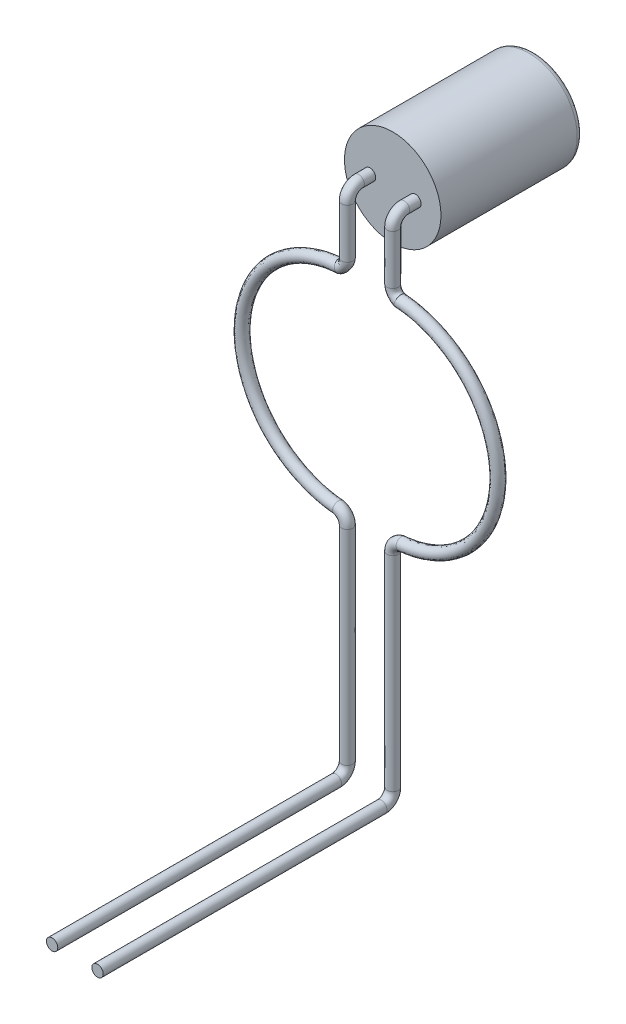
ISO-10303-21;
HEADER;
FILE_DESCRIPTION(('STEP AP214'),'2;1');
FILE_NAME('part.step','',(''),(''),'','','');
FILE_SCHEMA(('AUTOMOTIVE_DESIGN { 1 0 10303 214 1 1 1 1 }'));
ENDSEC;
DATA;
#1=APPLICATION_CONTEXT('core data for automotive mechanical design processes');
#2=APPLICATION_PROTOCOL_DEFINITION('international standard','automotive_design',2000,#1);
#3=PRODUCT_CONTEXT('',#1,'mechanical');
#4=PRODUCT('Part','Part','',(#3));
#5=PRODUCT_RELATED_PRODUCT_CATEGORY('part','',(#4));
#6=PRODUCT_DEFINITION_FORMATION('','',#4);
#7=PRODUCT_DEFINITION_CONTEXT('part definition',#1,'design');
#8=PRODUCT_DEFINITION('design','',#6,#7);
#9=PRODUCT_DEFINITION_SHAPE('','',#8);
#10=(LENGTH_UNIT() NAMED_UNIT(*) SI_UNIT(.MILLI.,.METRE.));
#11=(NAMED_UNIT(*) PLANE_ANGLE_UNIT() SI_UNIT($,.RADIAN.));
#12=(NAMED_UNIT(*) SI_UNIT($,.STERADIAN.) SOLID_ANGLE_UNIT());
#13=UNCERTAINTY_MEASURE_WITH_UNIT(LENGTH_MEASURE(1.E-05),#10,'distance_accuracy_value','');
#14=(GEOMETRIC_REPRESENTATION_CONTEXT(3) GLOBAL_UNCERTAINTY_ASSIGNED_CONTEXT((#13)) GLOBAL_UNIT_ASSIGNED_CONTEXT((#10,
#11,#12)) REPRESENTATION_CONTEXT('',''));
#15=CARTESIAN_POINT('',(0.,0.,0.));
#16=DIRECTION('',(0.,0.,1.));
#17=DIRECTION('',(1.,0.,0.));
#18=AXIS2_PLACEMENT_3D('',#15,#16,#17);
#19=CARTESIAN_POINT('',(0.,0.,1.25));
#20=DIRECTION('',(0.,0.,-1.));
#21=DIRECTION('',(-1.,0.,0.));
#22=AXIS2_PLACEMENT_3D('',#19,#20,#21);
#23=CYLINDRICAL_SURFACE('',#22,0.85);
#24=CARTESIAN_POINT('',(0.,0.,-1.15));
#25=DIRECTION('',(0.,0.,1.));
#26=DIRECTION('',(1.,0.,0.));
#27=AXIS2_PLACEMENT_3D('',#24,#25,#26);
#28=CIRCLE('',#27,0.85);
#29=CARTESIAN_POINT('',(0.85,0.,-1.15));
#30=VERTEX_POINT('',#29);
#31=EDGE_CURVE('E328',#30,#30,#28,.T.);
#32=ORIENTED_EDGE('',*,*,#31,.T.);
#33=EDGE_LOOP('',(#32));
#34=FACE_BOUND('',#33,.T.);
#35=CARTESIAN_POINT('',(0.,0.,1.25));
#36=DIRECTION('',(0.,0.,1.));
#37=DIRECTION('',(1.,0.,0.));
#38=AXIS2_PLACEMENT_3D('',#35,#36,#37);
#39=CIRCLE('',#38,0.85);
#40=CARTESIAN_POINT('',(0.85,0.,1.25));
#41=VERTEX_POINT('',#40);
#42=EDGE_CURVE('E185',#41,#41,#39,.T.);
#43=ORIENTED_EDGE('',*,*,#42,.F.);
#44=EDGE_LOOP('',(#43));
#45=FACE_BOUND('',#44,.T.);
#46=ADVANCED_FACE('F35',(#34,#45),#23,.T.);
#47=CARTESIAN_POINT('',(0.,0.,1.25));
#48=DIRECTION('',(0.,0.,1.));
#49=DIRECTION('',(1.,0.,0.));
#50=AXIS2_PLACEMENT_3D('',#47,#48,#49);
#51=PLANE('',#50);
#52=CARTESIAN_POINT('',(0.4,0.,1.25));
#53=DIRECTION('',(0.,0.,1.));
#54=DIRECTION('',(1.,0.,0.));
#55=AXIS2_PLACEMENT_3D('',#52,#53,#54);
#56=CIRCLE('',#55,0.1);
#57=CARTESIAN_POINT('',(0.5,0.,1.25));
#58=VERTEX_POINT('',#57);
#59=EDGE_CURVE('E11',#58,#58,#56,.T.);
#60=ORIENTED_EDGE('',*,*,#59,.F.);
#61=EDGE_LOOP('',(#60));
#62=FACE_BOUND('',#61,.T.);
#63=CARTESIAN_POINT('',(-0.4,0.,1.25));
#64=DIRECTION('',(0.,0.,1.));
#65=DIRECTION('',(1.,0.,0.));
#66=AXIS2_PLACEMENT_3D('',#63,#64,#65);
#67=CIRCLE('',#66,0.1);
#68=CARTESIAN_POINT('',(-0.3,0.,1.25));
#69=VERTEX_POINT('',#68);
#70=EDGE_CURVE('E43',#69,#69,#67,.T.);
#71=ORIENTED_EDGE('',*,*,#70,.F.);
#72=EDGE_LOOP('',(#71));
#73=FACE_BOUND('',#72,.T.);
#74=ORIENTED_EDGE('',*,*,#42,.T.);
#75=EDGE_LOOP('',(#74));
#76=FACE_BOUND('',#75,.T.);
#77=ADVANCED_FACE('F134',(#62,#73,#76),#51,.T.);
#78=CARTESIAN_POINT('',(0.,0.,-1.25));
#79=DIRECTION('',(0.,0.,1.));
#80=DIRECTION('',(1.,0.,0.));
#81=AXIS2_PLACEMENT_3D('',#78,#79,#80);
#82=PLANE('',#81);
#83=CARTESIAN_POINT('',(0.,0.,-1.25));
#84=DIRECTION('',(0.,0.,1.));
#85=DIRECTION('',(1.,0.,0.));
#86=AXIS2_PLACEMENT_3D('',#83,#84,#85);
#87=CIRCLE('',#86,0.75);
#88=CARTESIAN_POINT('',(0.75,0.,-1.25));
#89=VERTEX_POINT('',#88);
#90=EDGE_CURVE('E326',#89,#89,#87,.F.);
#91=ORIENTED_EDGE('',*,*,#90,.T.);
#92=EDGE_LOOP('',(#91));
#93=FACE_BOUND('',#92,.T.);
#94=ADVANCED_FACE('F139',(#93),#82,.F.);
#95=CARTESIAN_POINT('',(0.,0.,-1.15));
#96=DIRECTION('',(0.,0.,1.));
#97=DIRECTION('',(1.,0.,0.));
#98=AXIS2_PLACEMENT_3D('',#95,#96,#97);
#99=TOROIDAL_SURFACE('',#98,0.75,0.1);
#100=ORIENTED_EDGE('',*,*,#90,.F.);
#101=EDGE_LOOP('',(#100));
#102=FACE_BOUND('',#101,.T.);
#103=ORIENTED_EDGE('',*,*,#31,.F.);
#104=EDGE_LOOP('',(#103));
#105=FACE_BOUND('',#104,.T.);
#106=ADVANCED_FACE('F37',(#102,#105),#99,.T.);
#107=CARTESIAN_POINT('',(-0.399999999999998,-8.94598900638172,6.85));
#108=DIRECTION('',(0.,0.,1.));
#109=DIRECTION('',(1.,0.,0.));
#110=AXIS2_PLACEMENT_3D('',#107,#108,#109);
#111=PLANE('',#110);
#112=CARTESIAN_POINT('',(-0.399999999999998,-8.94598900638172,6.85));
#113=DIRECTION('',(0.,0.,1.));
#114=DIRECTION('',(1.,0.,0.));
#115=AXIS2_PLACEMENT_3D('',#112,#113,#114);
#116=CIRCLE('',#115,0.1);
#117=CARTESIAN_POINT('',(-0.299999999999998,-8.94598900638172,6.85));
#118=VERTEX_POINT('',#117);
#119=EDGE_CURVE('E48',#118,#118,#116,.T.);
#120=ORIENTED_EDGE('',*,*,#119,.T.);
#121=EDGE_LOOP('',(#120));
#122=FACE_BOUND('',#121,.T.);
#123=ADVANCED_FACE('F110',(#122),#111,.T.);
#124=CARTESIAN_POINT('',(-0.6,-5.14598900638171,1.65));
#125=DIRECTION('',(0.,0.,-1.));
#126=DIRECTION('',(-1.,0.,0.));
#127=AXIS2_PLACEMENT_3D('',#124,#125,#126);
#128=TOROIDAL_SURFACE('',#127,0.200000000000002,0.1);
#129=CARTESIAN_POINT('',(-0.399999999999999,-5.14598900638171,1.65));
#130=DIRECTION('',(0.,-1.,0.));
#131=DIRECTION('',(1.,0.,0.));
#132=AXIS2_PLACEMENT_3D('',#129,#130,#131);
#133=CIRCLE('',#132,0.1);
#134=CARTESIAN_POINT('',(-0.299999999999999,-5.14598900638171,1.65));
#135=VERTEX_POINT('',#134);
#136=EDGE_CURVE('E84',#135,#135,#133,.T.);
#137=ORIENTED_EDGE('',*,*,#136,.F.);
#138=EDGE_LOOP('',(#137));
#139=FACE_BOUND('',#138,.T.);
#140=CARTESIAN_POINT('',(-0.560183047886554,-4.9499925515046,1.65));
#141=DIRECTION('',(0.996254962561394,-0.086464151946315,0.));
#142=DIRECTION('',(0.0864641519463149,0.996254962561394,0.));
#143=AXIS2_PLACEMENT_3D('',#140,#141,#142);
#144=CIRCLE('',#143,0.1);
#145=CARTESIAN_POINT('',(-0.545905602260877,-4.85118068965726,1.65));
#146=VERTEX_POINT('',#145);
#147=EDGE_CURVE('E53',#146,#146,#144,.T.);
#148=ORIENTED_EDGE('',*,*,#147,.T.);
#149=EDGE_LOOP('',(#148));
#150=FACE_BOUND('',#149,.T.);
#151=ADVANCED_FACE('F150',(#139,#150),#128,.T.);
#152=CARTESIAN_POINT('',(-0.399999999999998,-5.14598900638171,1.65));
#153=DIRECTION('',(0.,-1.,0.));
#154=DIRECTION('',(0.,0.,-1.));
#155=AXIS2_PLACEMENT_3D('',#152,#153,#154);
#156=CYLINDRICAL_SURFACE('',#155,0.1);
#157=CARTESIAN_POINT('',(-0.399999999999998,-8.74598900638171,1.65));
#158=DIRECTION('',(0.,-1.,0.));
#159=DIRECTION('',(1.,0.,0.));
#160=AXIS2_PLACEMENT_3D('',#157,#158,#159);
#161=CIRCLE('',#160,0.1);
#162=CARTESIAN_POINT('',(-0.399999999999998,-8.74598900638171,1.55));
#163=VERTEX_POINT('',#162);
#164=EDGE_CURVE('E87',#163,#163,#161,.T.);
#165=ORIENTED_EDGE('',*,*,#164,.F.);
#166=EDGE_LOOP('',(#165));
#167=FACE_BOUND('',#166,.T.);
#168=ORIENTED_EDGE('',*,*,#136,.T.);
#169=EDGE_LOOP('',(#168));
#170=FACE_BOUND('',#169,.T.);
#171=ADVANCED_FACE('F159',(#167,#170),#156,.T.);
#172=CARTESIAN_POINT('',(-0.399999999999998,-8.74598900638171,1.85));
#173=DIRECTION('',(-1.,0.,0.));
#174=DIRECTION('',(0.,0.,1.));
#175=AXIS2_PLACEMENT_3D('',#172,#173,#174);
#176=TOROIDAL_SURFACE('',#175,0.200000000000001,0.1);
#177=CARTESIAN_POINT('',(-0.399999999999998,-8.94598900638171,1.85));
#178=DIRECTION('',(0.,0.,1.));
#179=DIRECTION('',(1.,0.,0.));
#180=AXIS2_PLACEMENT_3D('',#177,#178,#179);
#181=CIRCLE('',#180,0.1);
#182=CARTESIAN_POINT('',(-0.399999999999998,-9.04598900638171,1.85));
#183=VERTEX_POINT('',#182);
#184=EDGE_CURVE('E518',#183,#183,#181,.T.);
#185=CARTESIAN_POINT('',(-0.399999999999998,-8.74598900638171,1.85));
#186=DIRECTION('',(-1.,0.,0.));
#187=DIRECTION('',(0.,0.,1.));
#188=AXIS2_PLACEMENT_3D('',#185,#186,#187);
#189=CIRCLE('',#188,0.3);
#190=EDGE_CURVE('',#163,#183,#189,.T.);
#191=ORIENTED_EDGE('',*,*,#164,.T.);
#192=ORIENTED_EDGE('',*,*,#184,.F.);
#193=ORIENTED_EDGE('',*,*,#190,.T.);
#194=ORIENTED_EDGE('',*,*,#190,.F.);
#195=EDGE_LOOP('',(#191,#193,#192,#194));
#196=FACE_BOUND('',#195,.T.);
#197=ADVANCED_FACE('F155',(#196),#176,.T.);
#198=CARTESIAN_POINT('',(-0.399999999999998,-8.94598900638172,1.85));
#199=DIRECTION('',(0.,0.,1.));
#200=DIRECTION('',(1.,0.,0.));
#201=AXIS2_PLACEMENT_3D('',#198,#199,#200);
#202=CYLINDRICAL_SURFACE('',#201,0.1);
#203=ORIENTED_EDGE('',*,*,#119,.F.);
#204=EDGE_LOOP('',(#203));
#205=FACE_BOUND('',#204,.T.);
#206=ORIENTED_EDGE('',*,*,#184,.T.);
#207=EDGE_LOOP('',(#206));
#208=FACE_BOUND('',#207,.T.);
#209=ADVANCED_FACE('F151',(#205,#208),#202,.T.);
#210=CARTESIAN_POINT('',(-0.320313914255039,-1.3421668293797,1.65));
#211=CARTESIAN_POINT('',(-0.386824528835957,-1.3467256222584,1.65));
#212=CARTESIAN_POINT('',(-0.455131011311232,-1.35139897748724,1.65));
#213=CARTESIAN_POINT('',(-0.968453973995265,-1.38665099806308,1.65));
#214=CARTESIAN_POINT('',(-1.37636483013981,-1.58494097054743,1.65));
#215=CARTESIAN_POINT('',(-1.97464763676664,-2.21983956312003,1.65));
#216=CARTESIAN_POINT('',(-2.14856734212054,-2.65227258517285,1.65));
#217=CARTESIAN_POINT('',(-2.15647835242533,-3.52461247584773,1.65));
#218=CARTESIAN_POINT('',(-1.9904298387068,-3.96012857608279,1.65));
#219=CARTESIAN_POINT('',(-1.40375992577032,-4.60577317864002,1.65));
#220=CARTESIAN_POINT('',(-0.987092950947682,-4.81256547595763,1.65));
#221=CARTESIAN_POINT('',(-0.551536632691923,-4.85036705524846,1.65));
#222=CARTESIAN_POINT('',(-0.320313914255039,-1.3421668293797,1.85));
#223=CARTESIAN_POINT('',(-0.386824528835957,-1.3467256222584,1.85));
#224=CARTESIAN_POINT('',(-0.455131011311232,-1.35139897748724,1.85));
#225=CARTESIAN_POINT('',(-0.968453973995265,-1.38665099806308,1.85));
#226=CARTESIAN_POINT('',(-1.37636483013981,-1.58494097054743,1.85));
#227=CARTESIAN_POINT('',(-1.97464763676664,-2.21983956312003,1.85));
#228=CARTESIAN_POINT('',(-2.14856734212049,-2.65227258517285,1.85));
#229=CARTESIAN_POINT('',(-2.15647835242538,-3.52461247584773,1.85));
#230=CARTESIAN_POINT('',(-1.9904298387068,-3.96012857608279,1.85));
#231=CARTESIAN_POINT('',(-1.40375992577032,-4.60577317864002,1.85));
#232=CARTESIAN_POINT('',(-0.987092950947782,-4.81256547595773,1.85));
#233=CARTESIAN_POINT('',(-0.551536632691923,-4.85036705524846,1.85));
#234=CARTESIAN_POINT('',(-0.333990292891106,-1.1426349856369,1.85));
#235=CARTESIAN_POINT('',(-0.400500907472024,-1.1471937785156,1.85));
#236=CARTESIAN_POINT('',(-0.465217348780653,-1.15162009045159,1.85));
#237=CARTESIAN_POINT('',(-1.00701682821201,-1.18883167977311,1.85));
#238=CARTESIAN_POINT('',(-1.48778416885489,-1.4115529619925,1.85));
#239=CARTESIAN_POINT('',(-2.15434091635022,-2.11890396082949,1.85));
#240=CARTESIAN_POINT('',(-2.34810773004086,-2.60068472654156,1.85));
#241=CARTESIAN_POINT('',(-2.35692151716598,-3.57257299375931,1.85));
#242=CARTESIAN_POINT('',(-2.17192412796356,-4.05778866774967,1.85));
#243=CARTESIAN_POINT('',(-1.51830549696017,-4.77711197363766,1.85));
#244=CARTESIAN_POINT('',(-1.05408994463249,-5.00750268448573,1.85));
#245=CARTESIAN_POINT('',(-0.568829463081186,-5.04961804776074,1.85));
#246=CARTESIAN_POINT('',(-0.333990292891106,-1.1426349856369,1.65));
#247=CARTESIAN_POINT('',(-0.400500907472024,-1.1471937785156,1.65));
#248=CARTESIAN_POINT('',(-0.465217348780653,-1.15162009045159,1.65));
#249=CARTESIAN_POINT('',(-1.00701682821201,-1.18883167977311,1.65));
#250=CARTESIAN_POINT('',(-1.48778416885489,-1.4115529619925,1.65));
#251=CARTESIAN_POINT('',(-2.15434091635022,-2.11890396082949,1.65));
#252=CARTESIAN_POINT('',(-2.34810773004091,-2.60068472654156,1.65));
#253=CARTESIAN_POINT('',(-2.35692151716593,-3.57257299375931,1.65));
#254=CARTESIAN_POINT('',(-2.17192412796353,-4.05778866774967,1.65));
#255=CARTESIAN_POINT('',(-1.51830549696019,-4.77711197363766,1.65));
#256=CARTESIAN_POINT('',(-1.05408994463249,-5.00750268448573,1.65));
#257=CARTESIAN_POINT('',(-0.568829463081186,-5.04961804776074,1.65));
#258=CARTESIAN_POINT('',(-0.333990292891106,-1.1426349856369,1.45));
#259=CARTESIAN_POINT('',(-0.400500907472024,-1.1471937785156,1.45));
#260=CARTESIAN_POINT('',(-0.465217348780653,-1.15162009045159,1.45));
#261=CARTESIAN_POINT('',(-1.00701682821201,-1.18883167977311,1.45));
#262=CARTESIAN_POINT('',(-1.48778416885489,-1.4115529619925,1.45));
#263=CARTESIAN_POINT('',(-2.15434091635022,-2.11890396082949,1.45));
#264=CARTESIAN_POINT('',(-2.34810773004096,-2.60068472654156,1.45));
#265=CARTESIAN_POINT('',(-2.35692151716588,-3.57257299375931,1.45));
#266=CARTESIAN_POINT('',(-2.17192412796351,-4.05778866774967,1.45));
#267=CARTESIAN_POINT('',(-1.51830549696022,-4.77711197363766,1.45));
#268=CARTESIAN_POINT('',(-1.05408994463249,-5.00750268448573,1.45));
#269=CARTESIAN_POINT('',(-0.568829463081186,-5.04961804776074,1.45));
#270=CARTESIAN_POINT('',(-0.320313914255039,-1.3421668293797,1.45));
#271=CARTESIAN_POINT('',(-0.386824528835957,-1.3467256222584,1.45));
#272=CARTESIAN_POINT('',(-0.455131011311232,-1.35139897748724,1.45));
#273=CARTESIAN_POINT('',(-0.968453973995265,-1.38665099806308,1.45));
#274=CARTESIAN_POINT('',(-1.37636483013981,-1.58494097054743,1.45));
#275=CARTESIAN_POINT('',(-1.97464763676664,-2.21983956312003,1.45));
#276=CARTESIAN_POINT('',(-2.14856734212059,-2.65227258517285,1.45));
#277=CARTESIAN_POINT('',(-2.15647835242528,-3.52461247584773,1.45));
#278=CARTESIAN_POINT('',(-1.9904298387068,-3.96012857608279,1.45));
#279=CARTESIAN_POINT('',(-1.40375992577032,-4.60577317864002,1.45));
#280=CARTESIAN_POINT('',(-0.987092950947582,-4.81256547595753,1.45));
#281=CARTESIAN_POINT('',(-0.551536632691923,-4.85036705524846,1.45));
#282=CARTESIAN_POINT('',(-0.320313914255039,-1.3421668293797,1.65));
#283=CARTESIAN_POINT('',(-0.386824528835957,-1.3467256222584,1.65));
#284=CARTESIAN_POINT('',(-0.455131011311232,-1.35139897748724,1.65));
#285=CARTESIAN_POINT('',(-0.968453973995265,-1.38665099806308,1.65));
#286=CARTESIAN_POINT('',(-1.37636483013981,-1.58494097054743,1.65));
#287=CARTESIAN_POINT('',(-1.97464763676664,-2.21983956312003,1.65));
#288=CARTESIAN_POINT('',(-2.14856734212054,-2.65227258517285,1.65));
#289=CARTESIAN_POINT('',(-2.15647835242533,-3.52461247584773,1.65));
#290=CARTESIAN_POINT('',(-1.9904298387068,-3.96012857608279,1.65));
#291=CARTESIAN_POINT('',(-1.40375992577032,-4.60577317864002,1.65));
#292=CARTESIAN_POINT('',(-0.987092950947682,-4.81256547595763,1.65));
#293=CARTESIAN_POINT('',(-0.551536632691923,-4.85036705524846,1.65));
#294=(BOUNDED_SURFACE() B_SPLINE_SURFACE(3,3,((#210,#211,#212,#213,#214,#215,#216,#217,#218,
#219,#220,#221),(#222,#223,#224,#225,#226,#227,#228,#229,#230,#231,#232,#233),(#234,#235,#236,
#237,#238,#239,#240,#241,#242,#243,#244,#245),(#246,#247,#248,#249,#250,#251,#252,#253,#254,
#255,#256,#257),(#258,#259,#260,#261,#262,#263,#264,#265,#266,#267,#268,#269),(#270,#271,#272,
#273,#274,#275,#276,#277,#278,#279,#280,#281),(#282,#283,#284,#285,#286,#287,#288,#289,#290,
#291,#292,#293)),.UNSPECIFIED.,.T.,.F.,.F.) B_SPLINE_SURFACE_WITH_KNOTS((4,3,4),(4,2,2,2,2,4),
(0.,0.5,1.),(-0.0360641782622766,0.,0.25,0.5,0.75,1.),
.UNSPECIFIED.) GEOMETRIC_REPRESENTATION_ITEM() RATIONAL_B_SPLINE_SURFACE(((1.,1.,1.,1.,1.,1.,1.,
1.,1.,1.,1.,1.),(0.333333333333333,0.333333333333333,0.333333333333333,0.333333333333333,
0.333333333333333,0.333333333333333,0.333333333333333,0.333333333333333,0.333333333333333,
0.333333333333333,0.333333333333333,0.333333333333333),(0.333333333333333,0.333333333333333,
0.333333333333333,0.333333333333333,0.333333333333333,0.333333333333333,0.333333333333333,
0.333333333333333,0.333333333333333,0.333333333333333,0.333333333333333,0.333333333333333),(1.,
1.,1.,1.,1.,1.,1.,1.,1.,1.,1.,1.),(0.333333333333333,0.333333333333333,0.333333333333333,
0.333333333333333,0.333333333333333,0.333333333333333,0.333333333333333,0.333333333333333,
0.333333333333333,0.333333333333333,0.333333333333333,0.333333333333333),(0.333333333333333,
0.333333333333333,0.333333333333333,0.333333333333333,0.333333333333333,0.333333333333333,
0.333333333333333,0.333333333333333,0.333333333333333,0.333333333333333,0.333333333333333,
0.333333333333333),(1.,1.,1.,1.,1.,1.,1.,1.,1.,1.,1.,1.))) REPRESENTATION_ITEM('') SURFACE());
#295=CARTESIAN_POINT('',(-0.526683947315875,-1.25607728614437,1.55));
#296=CARTESIAN_POINT('',(-0.526416853962726,-1.25725743200403,1.54999945477346));
#297=CARTESIAN_POINT('',(-0.526149515452099,-1.25843865126105,1.55002098814878));
#298=CARTESIAN_POINT('',(-0.523151952408598,-1.27168309963214,1.55050810587876));
#299=CARTESIAN_POINT('',(-0.520416785252301,-1.28376719966588,1.55323687924054));
#300=CARTESIAN_POINT('',(-0.515545462847435,-1.30528780991801,1.56256131623488));
#301=CARTESIAN_POINT('',(-0.5133798274527,-1.31485464896088,1.5688529763735));
#302=CARTESIAN_POINT('',(-0.509651927393527,-1.33132244663684,1.58430611407469));
#303=CARTESIAN_POINT('',(-0.508084723168472,-1.3382452299072,1.5934429149672));
#304=CARTESIAN_POINT('',(-0.505735805218788,-1.34862094142141,1.6134579751396));
#305=CARTESIAN_POINT('',(-0.504945149076069,-1.35211337226941,1.62431469550801));
#306=CARTESIAN_POINT('',(-0.50421694911252,-1.35532992845187,1.64649164066506));
#307=CARTESIAN_POINT('',(-0.504271116002822,-1.35509066862818,1.65780627661743));
#308=CARTESIAN_POINT('',(-0.505203929941744,-1.35097029908951,1.67967041241208));
#309=CARTESIAN_POINT('',(-0.506079597249567,-1.34710235132699,1.69022252914732));
#310=CARTESIAN_POINT('',(-0.50855226210093,-1.33617997749352,1.70947546897725));
#311=CARTESIAN_POINT('',(-0.510152197741929,-1.32911257236364,1.71816853696748));
#312=CARTESIAN_POINT('',(-0.513928311275905,-1.31243169322777,1.73287772186388));
#313=CARTESIAN_POINT('',(-0.516116324004702,-1.30276592734387,1.73883115010044));
#314=CARTESIAN_POINT('',(-0.520829289634877,-1.28194473454604,1.74716931815929));
#315=CARTESIAN_POINT('',(-0.52335672014041,-1.2707783533225,1.74952607042707));
#316=CARTESIAN_POINT('',(-0.52614948929866,-1.25843876676343,1.74997891225516));
#317=CARTESIAN_POINT('',(-0.526416826865292,-1.25725755167308,1.7500004391514));
#318=CARTESIAN_POINT('',(-0.526683947315876,-1.25607728614437,1.75));
#319=B_SPLINE_CURVE_WITH_KNOTS('',3,(#295,#296,#297,#298,#299,#300,#301,#302,#303,#304,#305,
#306,#307,#308,#309,#310,#311,#312,#313,#314,#315,#316,#317,#318),.UNSPECIFIED.,.F.,.F.,(4,2,2,
2,2,2,2,2,2,2,2,4),(0.,0.00363296038412161,0.040727683527187,0.0750521251887425,
0.109086785135364,0.142724752316014,0.1760328777563,0.2092206533923,0.242544283442033,
0.276596547390638,0.310912461908523,0.314545422292646),.UNSPECIFIED.);
#320=CARTESIAN_POINT('',(-0.526683947315876,-1.25607728614437,1.75));
#321=VERTEX_POINT('',#320);
#322=CARTESIAN_POINT('',(-0.526683947315875,-1.25607728614437,1.55));
#323=VERTEX_POINT('',#322);
#324=EDGE_CURVE('E209',#321,#323,#319,.F.);
#325=CARTESIAN_POINT('',(-0.526683947315875,-1.25607728614437,1.55));
#326=CARTESIAN_POINT('',(-0.526951011568328,-1.25489711858859,1.54999947834686));
#327=CARTESIAN_POINT('',(-0.527219302755635,-1.25371611674632,1.55002100826793));
#328=CARTESIAN_POINT('',(-0.530237637364436,-1.24047709489119,1.55050773945927));
#329=CARTESIAN_POINT('',(-0.533086713823957,-1.22842068802513,1.55323290431081));
#330=CARTESIAN_POINT('',(-0.538220269939352,-1.20693489410127,1.56254755087526));
#331=CARTESIAN_POINT('',(-0.54053078977885,-1.19737794034182,1.56884020420876));
#332=CARTESIAN_POINT('',(-0.544469977956386,-1.18092774067056,1.58430618434828));
#333=CARTESIAN_POINT('',(-0.546104698873244,-1.17401089441268,1.59345259298921));
#334=CARTESIAN_POINT('',(-0.548503918550857,-1.16366132082313,1.61346218977642));
#335=CARTESIAN_POINT('',(-0.549280775302423,-1.16017919494375,1.6242983603883));
#336=CARTESIAN_POINT('',(-0.550000342610874,-1.15696137978385,1.64644787683648));
#337=CARTESIAN_POINT('',(-0.549949876718125,-1.15719504312278,1.65775655265758));
#338=CARTESIAN_POINT('',(-0.549028611683749,-1.16130253468337,1.6796404101379));
#339=CARTESIAN_POINT('',(-0.548158903426399,-1.16517152217384,1.69021654712764));
#340=CARTESIAN_POINT('',(-0.545617057652538,-1.17608540219437,1.7094810124055));
#341=CARTESIAN_POINT('',(-0.543943695003785,-1.18313514263175,1.71816642890583));
#342=CARTESIAN_POINT('',(-0.53998346628731,-1.19964931718217,1.7327636486787));
#343=CARTESIAN_POINT('',(-0.537691382203206,-1.20913425374877,1.73865062811258));
#344=CARTESIAN_POINT('',(-0.532740627117323,-1.22988584252071,1.74709535873414));
#345=CARTESIAN_POINT('',(-0.530071417990582,-1.24120604983144,1.74951970690956));
#346=CARTESIAN_POINT('',(-0.527219324528623,-1.25371603361262,1.74997892129478));
#347=CARTESIAN_POINT('',(-0.526951034038423,-1.25489703309873,1.75000044705368));
#348=CARTESIAN_POINT('',(-0.526683947315876,-1.25607728614437,1.75));
#349=B_SPLINE_CURVE_WITH_KNOTS('',3,(#325,#326,#327,#328,#329,#330,#331,#332,#333,#334,#335,
#336,#337,#338,#339,#340,#341,#342,#343,#344,#345,#346,#347,#348),.UNSPECIFIED.,.F.,.F.,(4,2,2,
2,2,2,2,2,2,2,2,4),(0.,0.00363296129542657,0.0407260078495858,0.0751094271185845,
0.109177857458853,0.142748838826554,0.176043075449436,0.20929304081002,0.242593855808893,
0.276184797826031,0.311037879845327,0.314670841140304),.UNSPECIFIED.);
#350=EDGE_CURVE('E211',#321,#323,#349,.F.);
#351=ORIENTED_EDGE('',*,*,#324,.F.);
#352=ORIENTED_EDGE('',*,*,#350,.T.);
#353=EDGE_LOOP('',(#351,#352));
#354=FACE_BOUND('',#353,.T.);
#355=ORIENTED_EDGE('',*,*,#147,.F.);
#356=EDGE_LOOP('',(#355));
#357=FACE_BOUND('',#356,.T.);
#358=ADVANCED_FACE('F154',(#354,#357),#294,.T.);
#359=CARTESIAN_POINT('',(-0.4,0.,1.25));
#360=DIRECTION('',(0.,0.,1.));
#361=DIRECTION('',(1.,0.,0.));
#362=AXIS2_PLACEMENT_3D('',#359,#360,#361);
#363=CYLINDRICAL_SURFACE('',#362,0.1);
#364=CARTESIAN_POINT('',(-0.4,0.,1.45));
#365=DIRECTION('',(0.,0.,1.));
#366=DIRECTION('',(1.,0.,0.));
#367=AXIS2_PLACEMENT_3D('',#364,#365,#366);
#368=CIRCLE('',#367,0.1);
#369=CARTESIAN_POINT('',(-0.4,0.1,1.45));
#370=VERTEX_POINT('',#369);
#371=EDGE_CURVE('E184',#370,#370,#368,.T.);
#372=ORIENTED_EDGE('',*,*,#371,.F.);
#373=EDGE_LOOP('',(#372));
#374=FACE_BOUND('',#373,.T.);
#375=ORIENTED_EDGE('',*,*,#70,.T.);
#376=EDGE_LOOP('',(#375));
#377=FACE_BOUND('',#376,.T.);
#378=ADVANCED_FACE('F200',(#374,#377),#363,.T.);
#379=CARTESIAN_POINT('',(-0.4,-0.2,1.45));
#380=DIRECTION('',(1.,0.,0.));
#381=DIRECTION('',(0.,0.,-1.));
#382=AXIS2_PLACEMENT_3D('',#379,#380,#381);
#383=TOROIDAL_SURFACE('',#382,0.2,0.1);
#384=CARTESIAN_POINT('',(-0.4,-0.2,1.65));
#385=DIRECTION('',(0.,-1.,0.));
#386=DIRECTION('',(1.,0.,0.));
#387=AXIS2_PLACEMENT_3D('',#384,#385,#386);
#388=CIRCLE('',#387,0.1);
#389=CARTESIAN_POINT('',(-0.4,-0.2,1.75));
#390=VERTEX_POINT('',#389);
#391=EDGE_CURVE('E219',#390,#390,#388,.T.);
#392=CARTESIAN_POINT('',(-0.4,-0.2,1.45));
#393=DIRECTION('',(1.,0.,0.));
#394=DIRECTION('',(0.,0.,-1.));
#395=AXIS2_PLACEMENT_3D('',#392,#393,#394);
#396=CIRCLE('',#395,0.3);
#397=EDGE_CURVE('',#370,#390,#396,.T.);
#398=ORIENTED_EDGE('',*,*,#371,.T.);
#399=ORIENTED_EDGE('',*,*,#391,.F.);
#400=ORIENTED_EDGE('',*,*,#397,.T.);
#401=ORIENTED_EDGE('',*,*,#397,.F.);
#402=EDGE_LOOP('',(#398,#400,#399,#401));
#403=FACE_BOUND('',#402,.T.);
#404=ADVANCED_FACE('F205',(#403),#383,.T.);
#405=CARTESIAN_POINT('',(-0.4,-0.2,1.65));
#406=DIRECTION('',(0.,-1.,0.));
#407=DIRECTION('',(0.,0.,-1.));
#408=AXIS2_PLACEMENT_3D('',#405,#406,#407);
#409=CYLINDRICAL_SURFACE('',#408,0.1);
#410=CARTESIAN_POINT('',(-0.4,-1.07,1.65));
#411=DIRECTION('',(0.,-1.,0.));
#412=DIRECTION('',(1.,0.,0.));
#413=AXIS2_PLACEMENT_3D('',#410,#411,#412);
#414=CIRCLE('',#413,0.1);
#415=CARTESIAN_POINT('',(-0.3,-1.07,1.65));
#416=VERTEX_POINT('',#415);
#417=EDGE_CURVE('E216',#416,#416,#414,.T.);
#418=ORIENTED_EDGE('',*,*,#417,.F.);
#419=EDGE_LOOP('',(#418));
#420=FACE_BOUND('',#419,.T.);
#421=ORIENTED_EDGE('',*,*,#391,.T.);
#422=EDGE_LOOP('',(#421));
#423=FACE_BOUND('',#422,.T.);
#424=ADVANCED_FACE('F238',(#420,#423),#409,.T.);
#425=CARTESIAN_POINT('',(-0.3,-1.07,1.65));
#426=CARTESIAN_POINT('',(-0.3,-1.16962213238677,1.65));
#427=CARTESIAN_POINT('',(-0.396075480806249,-1.31193580295551,1.65));
#428=CARTESIAN_POINT('',(-0.567500778193534,-1.37977597687934,1.65));
#429=CARTESIAN_POINT('',(-0.614077445069928,-1.39799329767264,1.65));
#430=CARTESIAN_POINT('',(-0.676103207118016,-1.4224319819007,1.65));
#431=CARTESIAN_POINT('',(-0.3,-1.07,1.85));
#432=CARTESIAN_POINT('',(-0.3,-1.16962213238677,1.85));
#433=CARTESIAN_POINT('',(-0.396075480806249,-1.31193580295551,1.85));
#434=CARTESIAN_POINT('',(-0.567500778193534,-1.37977597687934,1.85));
#435=CARTESIAN_POINT('',(-0.614077445069928,-1.39799329767264,1.85));
#436=CARTESIAN_POINT('',(-0.676103207118016,-1.4224319819007,1.85));
#437=CARTESIAN_POINT('',(-0.5,-1.07,1.85));
#438=CARTESIAN_POINT('',(-0.5,-1.12977327943208,1.85));
#439=CARTESIAN_POINT('',(-0.506953165494128,-1.14076668586535,1.85));
#440=CARTESIAN_POINT('',(-0.609842180080612,-1.18140488703589,1.85));
#441=CARTESIAN_POINT('',(-0.687393497754135,-1.2119160115284,1.85));
#442=CARTESIAN_POINT('',(-0.749419259802224,-1.23635469575645,1.85));
#443=CARTESIAN_POINT('',(-0.5,-1.07,1.65));
#444=CARTESIAN_POINT('',(-0.5,-1.12977327943208,1.65));
#445=CARTESIAN_POINT('',(-0.506953165494128,-1.14076668586535,1.65));
#446=CARTESIAN_POINT('',(-0.609842180080612,-1.18140488703589,1.65));
#447=CARTESIAN_POINT('',(-0.687393497754135,-1.2119160115284,1.65));
#448=CARTESIAN_POINT('',(-0.749419259802224,-1.23635469575645,1.65));
#449=CARTESIAN_POINT('',(-0.5,-1.07,1.45));
#450=CARTESIAN_POINT('',(-0.5,-1.12977327943208,1.45));
#451=CARTESIAN_POINT('',(-0.506953165494128,-1.14076668586535,1.45));
#452=CARTESIAN_POINT('',(-0.609842180080612,-1.18140488703589,1.45));
#453=CARTESIAN_POINT('',(-0.687393497754135,-1.2119160115284,1.45));
#454=CARTESIAN_POINT('',(-0.749419259802224,-1.23635469575645,1.45));
#455=CARTESIAN_POINT('',(-0.3,-1.07,1.45));
#456=CARTESIAN_POINT('',(-0.3,-1.16962213238677,1.45));
#457=CARTESIAN_POINT('',(-0.396075480806249,-1.31193580295551,1.45));
#458=CARTESIAN_POINT('',(-0.567500778193534,-1.37977597687934,1.45));
#459=CARTESIAN_POINT('',(-0.614077445069928,-1.39799329767264,1.45));
#460=CARTESIAN_POINT('',(-0.676103207118016,-1.4224319819007,1.45));
#461=CARTESIAN_POINT('',(-0.3,-1.07,1.65));
#462=CARTESIAN_POINT('',(-0.3,-1.16962213238677,1.65));
#463=CARTESIAN_POINT('',(-0.396075480806249,-1.31193580295551,1.65));
#464=CARTESIAN_POINT('',(-0.567500778193534,-1.37977597687934,1.65));
#465=CARTESIAN_POINT('',(-0.614077445069928,-1.39799329767264,1.65));
#466=CARTESIAN_POINT('',(-0.676103207118016,-1.4224319819007,1.65));
#467=(BOUNDED_SURFACE() B_SPLINE_SURFACE(3,3,((#425,#426,#427,#428,#429,#430),(#431,#432,#433,
#434,#435,#436),(#437,#438,#439,#440,#441,#442),(#443,#444,#445,#446,#447,#448),(#449,#450,#451,
#452,#453,#454),(#455,#456,#457,#458,#459,#460),(#461,#462,#463,#464,#465,#466)),.UNSPECIFIED.,
.T.,.F.,.F.) B_SPLINE_SURFACE_WITH_KNOTS((4,3,4),(4,2,4),(0.,0.5,1.),(0.852707366876897,1.,
1.12146271694297),.UNSPECIFIED.) GEOMETRIC_REPRESENTATION_ITEM() RATIONAL_B_SPLINE_SURFACE(((1.,
1.,1.,1.,1.,1.),(0.333333333333333,0.333333333333333,0.333333333333333,0.333333333333333,
0.333333333333333,0.333333333333333),(0.333333333333333,0.333333333333333,0.333333333333333,
0.333333333333333,0.333333333333333,0.333333333333333),(1.,1.,1.,1.,1.,1.),(0.333333333333333,
0.333333333333333,0.333333333333333,0.333333333333333,0.333333333333333,0.333333333333333),
(0.333333333333333,0.333333333333333,0.333333333333333,0.333333333333333,0.333333333333333,
0.333333333333333),(1.,1.,1.,1.,1.,1.))) REPRESENTATION_ITEM('') SURFACE());
#468=ORIENTED_EDGE('',*,*,#350,.F.);
#469=ORIENTED_EDGE('',*,*,#324,.T.);
#470=EDGE_LOOP('',(#468,#469));
#471=FACE_BOUND('',#470,.T.);
#472=ORIENTED_EDGE('',*,*,#417,.T.);
#473=EDGE_LOOP('',(#472));
#474=FACE_BOUND('',#473,.T.);
#475=ADVANCED_FACE('F214',(#471,#474),#467,.T.);
#476=CARTESIAN_POINT('',(0.399999999999998,-8.94598900638172,6.85));
#477=DIRECTION('',(0.,0.,1.));
#478=DIRECTION('',(-1.,0.,0.));
#479=AXIS2_PLACEMENT_3D('',#476,#477,#478);
#480=PLANE('',#479);
#481=CARTESIAN_POINT('',(0.399999999999998,-8.94598900638172,6.85));
#482=DIRECTION('',(0.,0.,-1.));
#483=DIRECTION('',(-1.,0.,0.));
#484=AXIS2_PLACEMENT_3D('',#481,#482,#483);
#485=CIRCLE('',#484,0.1);
#486=CARTESIAN_POINT('',(0.299999999999998,-8.94598900638172,6.85));
#487=VERTEX_POINT('',#486);
#488=EDGE_CURVE('E287',#487,#487,#485,.F.);
#489=ORIENTED_EDGE('',*,*,#488,.T.);
#490=EDGE_LOOP('',(#489));
#491=FACE_BOUND('',#490,.T.);
#492=ADVANCED_FACE('F237',(#491),#480,.T.);
#493=CARTESIAN_POINT('',(0.6,-5.14598900638171,1.65));
#494=DIRECTION('',(0.,0.,1.));
#495=DIRECTION('',(1.,0.,0.));
#496=AXIS2_PLACEMENT_3D('',#493,#494,#495);
#497=TOROIDAL_SURFACE('',#496,0.200000000000002,0.1);
#498=CARTESIAN_POINT('',(0.399999999999999,-5.14598900638171,1.65));
#499=DIRECTION('',(0.,1.,0.));
#500=DIRECTION('',(-1.,0.,0.));
#501=AXIS2_PLACEMENT_3D('',#498,#499,#500);
#502=CIRCLE('',#501,0.1);
#503=CARTESIAN_POINT('',(0.299999999999999,-5.14598900638171,1.65));
#504=VERTEX_POINT('',#503);
#505=EDGE_CURVE('E307',#504,#504,#502,.F.);
#506=ORIENTED_EDGE('',*,*,#505,.F.);
#507=EDGE_LOOP('',(#506));
#508=FACE_BOUND('',#507,.T.);
#509=CARTESIAN_POINT('',(0.560183047886554,-4.9499925515046,1.65));
#510=DIRECTION('',(0.996254962561394,0.086464151946315,0.));
#511=DIRECTION('',(-0.0864641519463149,0.996254962561394,0.));
#512=AXIS2_PLACEMENT_3D('',#509,#510,#511);
#513=CIRCLE('',#512,0.1);
#514=CARTESIAN_POINT('',(0.545905602260877,-4.85118068965726,1.65));
#515=VERTEX_POINT('',#514);
#516=EDGE_CURVE('E278',#515,#515,#513,.F.);
#517=ORIENTED_EDGE('',*,*,#516,.T.);
#518=EDGE_LOOP('',(#517));
#519=FACE_BOUND('',#518,.T.);
#520=ADVANCED_FACE('F253',(#508,#519),#497,.T.);
#521=CARTESIAN_POINT('',(0.399999999999998,-5.14598900638171,1.65));
#522=DIRECTION('',(0.,-1.,0.));
#523=DIRECTION('',(0.,0.,-1.));
#524=AXIS2_PLACEMENT_3D('',#521,#522,#523);
#525=CYLINDRICAL_SURFACE('',#524,0.1);
#526=CARTESIAN_POINT('',(0.399999999999998,-8.74598900638171,1.65));
#527=DIRECTION('',(0.,1.,0.));
#528=DIRECTION('',(-1.,0.,0.));
#529=AXIS2_PLACEMENT_3D('',#526,#527,#528);
#530=CIRCLE('',#529,0.1);
#531=CARTESIAN_POINT('',(0.399999999999998,-8.74598900638171,1.55));
#532=VERTEX_POINT('',#531);
#533=EDGE_CURVE('E305',#532,#532,#530,.F.);
#534=ORIENTED_EDGE('',*,*,#533,.F.);
#535=EDGE_LOOP('',(#534));
#536=FACE_BOUND('',#535,.T.);
#537=ORIENTED_EDGE('',*,*,#505,.T.);
#538=EDGE_LOOP('',(#537));
#539=FACE_BOUND('',#538,.T.);
#540=ADVANCED_FACE('F261',(#536,#539),#525,.T.);
#541=CARTESIAN_POINT('',(0.399999999999998,-8.74598900638171,1.85));
#542=DIRECTION('',(-1.,0.,0.));
#543=DIRECTION('',(0.,0.,1.));
#544=AXIS2_PLACEMENT_3D('',#541,#542,#543);
#545=TOROIDAL_SURFACE('',#544,0.200000000000001,0.1);
#546=CARTESIAN_POINT('',(0.399999999999998,-8.94598900638171,1.85));
#547=DIRECTION('',(0.,0.,-1.));
#548=DIRECTION('',(-1.,0.,0.));
#549=AXIS2_PLACEMENT_3D('',#546,#547,#548);
#550=CIRCLE('',#549,0.1);
#551=CARTESIAN_POINT('',(0.399999999999998,-9.04598900638171,1.85));
#552=VERTEX_POINT('',#551);
#553=EDGE_CURVE('E302',#552,#552,#550,.F.);
#554=CARTESIAN_POINT('',(0.399999999999998,-8.74598900638171,1.85));
#555=DIRECTION('',(-1.,0.,0.));
#556=DIRECTION('',(0.,0.,1.));
#557=AXIS2_PLACEMENT_3D('',#554,#555,#556);
#558=CIRCLE('',#557,0.3);
#559=EDGE_CURVE('',#532,#552,#558,.T.);
#560=ORIENTED_EDGE('',*,*,#533,.T.);
#561=ORIENTED_EDGE('',*,*,#553,.F.);
#562=ORIENTED_EDGE('',*,*,#559,.T.);
#563=ORIENTED_EDGE('',*,*,#559,.F.);
#564=EDGE_LOOP('',(#560,#562,#561,#563));
#565=FACE_BOUND('',#564,.T.);
#566=ADVANCED_FACE('F257',(#565),#545,.T.);
#567=CARTESIAN_POINT('',(0.399999999999998,-8.94598900638172,1.85));
#568=DIRECTION('',(0.,0.,1.));
#569=DIRECTION('',(1.,0.,0.));
#570=AXIS2_PLACEMENT_3D('',#567,#568,#569);
#571=CYLINDRICAL_SURFACE('',#570,0.1);
#572=ORIENTED_EDGE('',*,*,#488,.F.);
#573=EDGE_LOOP('',(#572));
#574=FACE_BOUND('',#573,.T.);
#575=ORIENTED_EDGE('',*,*,#553,.T.);
#576=EDGE_LOOP('',(#575));
#577=FACE_BOUND('',#576,.T.);
#578=ADVANCED_FACE('F130',(#574,#577),#571,.T.);
#579=CARTESIAN_POINT('',(0.320313914255039,-1.3421668293797,1.65));
#580=CARTESIAN_POINT('',(0.386824528835957,-1.3467256222584,1.65));
#581=CARTESIAN_POINT('',(0.455131011311232,-1.35139897748724,1.65));
#582=CARTESIAN_POINT('',(0.968453973995265,-1.38665099806308,1.65));
#583=CARTESIAN_POINT('',(1.37636483013981,-1.58494097054743,1.65));
#584=CARTESIAN_POINT('',(1.97464763676664,-2.21983956312003,1.65));
#585=CARTESIAN_POINT('',(2.14856734212054,-2.65227258517285,1.65));
#586=CARTESIAN_POINT('',(2.15647835242533,-3.52461247584773,1.65));
#587=CARTESIAN_POINT('',(1.9904298387068,-3.96012857608279,1.65));
#588=CARTESIAN_POINT('',(1.40375992577032,-4.60577317864002,1.65));
#589=CARTESIAN_POINT('',(0.987092950947682,-4.81256547595763,1.65));
#590=CARTESIAN_POINT('',(0.551536632691923,-4.85036705524846,1.65));
#591=CARTESIAN_POINT('',(0.320313914255039,-1.3421668293797,1.45));
#592=CARTESIAN_POINT('',(0.386824528835957,-1.3467256222584,1.45));
#593=CARTESIAN_POINT('',(0.455131011311232,-1.35139897748724,1.45));
#594=CARTESIAN_POINT('',(0.968453973995265,-1.38665099806308,1.45));
#595=CARTESIAN_POINT('',(1.37636483013981,-1.58494097054743,1.45));
#596=CARTESIAN_POINT('',(1.97464763676664,-2.21983956312003,1.45));
#597=CARTESIAN_POINT('',(2.14856734212059,-2.65227258517285,1.45));
#598=CARTESIAN_POINT('',(2.15647835242528,-3.52461247584773,1.45));
#599=CARTESIAN_POINT('',(1.9904298387068,-3.96012857608279,1.45));
#600=CARTESIAN_POINT('',(1.40375992577032,-4.60577317864002,1.45));
#601=CARTESIAN_POINT('',(0.987092950947582,-4.81256547595753,1.45));
#602=CARTESIAN_POINT('',(0.551536632691923,-4.85036705524846,1.45));
#603=CARTESIAN_POINT('',(0.333990292891106,-1.1426349856369,1.45));
#604=CARTESIAN_POINT('',(0.400500907472024,-1.1471937785156,1.45));
#605=CARTESIAN_POINT('',(0.465217348780653,-1.15162009045159,1.45));
#606=CARTESIAN_POINT('',(1.00701682821201,-1.18883167977311,1.45));
#607=CARTESIAN_POINT('',(1.48778416885489,-1.4115529619925,1.45));
#608=CARTESIAN_POINT('',(2.15434091635022,-2.11890396082949,1.45));
#609=CARTESIAN_POINT('',(2.34810773004096,-2.60068472654156,1.45));
#610=CARTESIAN_POINT('',(2.35692151716588,-3.57257299375931,1.45));
#611=CARTESIAN_POINT('',(2.17192412796351,-4.05778866774967,1.45));
#612=CARTESIAN_POINT('',(1.51830549696022,-4.77711197363766,1.45));
#613=CARTESIAN_POINT('',(1.05408994463249,-5.00750268448573,1.45));
#614=CARTESIAN_POINT('',(0.568829463081186,-5.04961804776074,1.45));
#615=CARTESIAN_POINT('',(0.333990292891106,-1.1426349856369,1.65));
#616=CARTESIAN_POINT('',(0.400500907472024,-1.1471937785156,1.65));
#617=CARTESIAN_POINT('',(0.465217348780653,-1.15162009045159,1.65));
#618=CARTESIAN_POINT('',(1.00701682821201,-1.18883167977311,1.65));
#619=CARTESIAN_POINT('',(1.48778416885489,-1.4115529619925,1.65));
#620=CARTESIAN_POINT('',(2.15434091635022,-2.11890396082949,1.65));
#621=CARTESIAN_POINT('',(2.34810773004091,-2.60068472654156,1.65));
#622=CARTESIAN_POINT('',(2.35692151716593,-3.57257299375931,1.65));
#623=CARTESIAN_POINT('',(2.17192412796353,-4.05778866774967,1.65));
#624=CARTESIAN_POINT('',(1.51830549696019,-4.77711197363766,1.65));
#625=CARTESIAN_POINT('',(1.05408994463249,-5.00750268448573,1.65));
#626=CARTESIAN_POINT('',(0.568829463081186,-5.04961804776074,1.65));
#627=CARTESIAN_POINT('',(0.333990292891106,-1.1426349856369,1.85));
#628=CARTESIAN_POINT('',(0.400500907472024,-1.1471937785156,1.85));
#629=CARTESIAN_POINT('',(0.465217348780653,-1.15162009045159,1.85));
#630=CARTESIAN_POINT('',(1.00701682821201,-1.18883167977311,1.85));
#631=CARTESIAN_POINT('',(1.48778416885489,-1.4115529619925,1.85));
#632=CARTESIAN_POINT('',(2.15434091635022,-2.11890396082949,1.85));
#633=CARTESIAN_POINT('',(2.34810773004086,-2.60068472654156,1.85));
#634=CARTESIAN_POINT('',(2.35692151716598,-3.57257299375931,1.85));
#635=CARTESIAN_POINT('',(2.17192412796356,-4.05778866774967,1.85));
#636=CARTESIAN_POINT('',(1.51830549696017,-4.77711197363766,1.85));
#637=CARTESIAN_POINT('',(1.05408994463249,-5.00750268448573,1.85));
#638=CARTESIAN_POINT('',(0.568829463081186,-5.04961804776074,1.85));
#639=CARTESIAN_POINT('',(0.320313914255039,-1.3421668293797,1.85));
#640=CARTESIAN_POINT('',(0.386824528835957,-1.3467256222584,1.85));
#641=CARTESIAN_POINT('',(0.455131011311232,-1.35139897748724,1.85));
#642=CARTESIAN_POINT('',(0.968453973995265,-1.38665099806308,1.85));
#643=CARTESIAN_POINT('',(1.37636483013981,-1.58494097054743,1.85));
#644=CARTESIAN_POINT('',(1.97464763676664,-2.21983956312003,1.85));
#645=CARTESIAN_POINT('',(2.14856734212049,-2.65227258517285,1.85));
#646=CARTESIAN_POINT('',(2.15647835242538,-3.52461247584773,1.85));
#647=CARTESIAN_POINT('',(1.9904298387068,-3.96012857608279,1.85));
#648=CARTESIAN_POINT('',(1.40375992577032,-4.60577317864002,1.85));
#649=CARTESIAN_POINT('',(0.987092950947782,-4.81256547595773,1.85));
#650=CARTESIAN_POINT('',(0.551536632691923,-4.85036705524846,1.85));
#651=CARTESIAN_POINT('',(0.320313914255039,-1.3421668293797,1.65));
#652=CARTESIAN_POINT('',(0.386824528835957,-1.3467256222584,1.65));
#653=CARTESIAN_POINT('',(0.455131011311232,-1.35139897748724,1.65));
#654=CARTESIAN_POINT('',(0.968453973995265,-1.38665099806308,1.65));
#655=CARTESIAN_POINT('',(1.37636483013981,-1.58494097054743,1.65));
#656=CARTESIAN_POINT('',(1.97464763676664,-2.21983956312003,1.65));
#657=CARTESIAN_POINT('',(2.14856734212054,-2.65227258517285,1.65));
#658=CARTESIAN_POINT('',(2.15647835242533,-3.52461247584773,1.65));
#659=CARTESIAN_POINT('',(1.9904298387068,-3.96012857608279,1.65));
#660=CARTESIAN_POINT('',(1.40375992577032,-4.60577317864002,1.65));
#661=CARTESIAN_POINT('',(0.987092950947682,-4.81256547595763,1.65));
#662=CARTESIAN_POINT('',(0.551536632691923,-4.85036705524846,1.65));
#663=(BOUNDED_SURFACE() B_SPLINE_SURFACE(3,3,((#579,#580,#581,#582,#583,#584,#585,#586,#587,
#588,#589,#590),(#591,#592,#593,#594,#595,#596,#597,#598,#599,#600,#601,#602),(#603,#604,#605,
#606,#607,#608,#609,#610,#611,#612,#613,#614),(#615,#616,#617,#618,#619,#620,#621,#622,#623,
#624,#625,#626),(#627,#628,#629,#630,#631,#632,#633,#634,#635,#636,#637,#638),(#639,#640,#641,
#642,#643,#644,#645,#646,#647,#648,#649,#650),(#651,#652,#653,#654,#655,#656,#657,#658,#659,
#660,#661,#662)),.UNSPECIFIED.,.T.,.F.,.F.) B_SPLINE_SURFACE_WITH_KNOTS((4,3,4),(4,2,2,2,2,4),
(0.,0.5,1.),(-0.0360641782622766,0.,0.25,0.5,0.75,1.),
.UNSPECIFIED.) GEOMETRIC_REPRESENTATION_ITEM() RATIONAL_B_SPLINE_SURFACE(((1.,1.,1.,1.,1.,1.,1.,
1.,1.,1.,1.,1.),(0.333333333333333,0.333333333333333,0.333333333333333,0.333333333333333,
0.333333333333333,0.333333333333333,0.333333333333333,0.333333333333333,0.333333333333333,
0.333333333333333,0.333333333333333,0.333333333333333),(0.333333333333333,0.333333333333333,
0.333333333333333,0.333333333333333,0.333333333333333,0.333333333333333,0.333333333333333,
0.333333333333333,0.333333333333333,0.333333333333333,0.333333333333333,0.333333333333333),(1.,
1.,1.,1.,1.,1.,1.,1.,1.,1.,1.,1.),(0.333333333333333,0.333333333333333,0.333333333333333,
0.333333333333333,0.333333333333333,0.333333333333333,0.333333333333333,0.333333333333333,
0.333333333333333,0.333333333333333,0.333333333333333,0.333333333333333),(0.333333333333333,
0.333333333333333,0.333333333333333,0.333333333333333,0.333333333333333,0.333333333333333,
0.333333333333333,0.333333333333333,0.333333333333333,0.333333333333333,0.333333333333333,
0.333333333333333),(1.,1.,1.,1.,1.,1.,1.,1.,1.,1.,1.,1.))) REPRESENTATION_ITEM('') SURFACE());
#664=CARTESIAN_POINT('',(0.526683947315877,-1.25607728614437,1.75));
#665=CARTESIAN_POINT('',(0.526416853962756,-1.25725743200404,1.75000054522654));
#666=CARTESIAN_POINT('',(0.526149515452153,-1.25843865126107,1.74997901185122));
#667=CARTESIAN_POINT('',(0.523151952408877,-1.27168309963221,1.74949189412124));
#668=CARTESIAN_POINT('',(0.520416785252381,-1.2837671996659,1.74676312075946));
#669=CARTESIAN_POINT('',(0.515545462847381,-1.30528780991799,1.73743868376512));
#670=CARTESIAN_POINT('',(0.513379827452691,-1.31485464896088,1.7311470236265));
#671=CARTESIAN_POINT('',(0.50965192739355,-1.33132244663684,1.71569388592531));
#672=CARTESIAN_POINT('',(0.508084723168481,-1.3382452299072,1.7065570850328));
#673=CARTESIAN_POINT('',(0.505735805218785,-1.34862094142141,1.68654202486041));
#674=CARTESIAN_POINT('',(0.504945149076067,-1.35211337226941,1.67568530449199));
#675=CARTESIAN_POINT('',(0.504216949112518,-1.35532992845187,1.65350835933494));
#676=CARTESIAN_POINT('',(0.504271116002822,-1.35509066862818,1.64219372338257));
#677=CARTESIAN_POINT('',(0.505203929941746,-1.35097029908951,1.62032958758792));
#678=CARTESIAN_POINT('',(0.506079597249571,-1.34710235132699,1.60977747085268));
#679=CARTESIAN_POINT('',(0.508552262100921,-1.33617997749352,1.59052453102275));
#680=CARTESIAN_POINT('',(0.510152197741904,-1.32911257236364,1.58183146303252));
#681=CARTESIAN_POINT('',(0.51392831127593,-1.31243169322777,1.56712227813612));
#682=CARTESIAN_POINT('',(0.516116324004794,-1.30276592734389,1.56116884989956));
#683=CARTESIAN_POINT('',(0.520829289634767,-1.28194473454601,1.55283068184071));
#684=CARTESIAN_POINT('',(0.523356720140028,-1.27077835332242,1.55047392957293));
#685=CARTESIAN_POINT('',(0.52614948929858,-1.25843876676341,1.55002108774484));
#686=CARTESIAN_POINT('',(0.526416826865247,-1.25725755167307,1.54999956084861));
#687=CARTESIAN_POINT('',(0.526683947315874,-1.25607728614437,1.55));
#688=B_SPLINE_CURVE_WITH_KNOTS('',3,(#664,#665,#666,#667,#668,#669,#670,#671,#672,#673,#674,
#675,#676,#677,#678,#679,#680,#681,#682,#683,#684,#685,#686,#687),.UNSPECIFIED.,.F.,.F.,(4,2,2,
2,2,2,2,2,2,2,2,4),(0.,0.00363296038412151,0.0407276835271857,0.0750521251887425,
0.109086785135363,0.142724752316013,0.1760328777563,0.209220653392301,0.242544283442032,
0.276596547390636,0.310912461908522,0.314545422292646),.UNSPECIFIED.);
#689=CARTESIAN_POINT('',(0.526683947315874,-1.25607728614437,1.55));
#690=VERTEX_POINT('',#689);
#691=CARTESIAN_POINT('',(0.526683947315877,-1.25607728614437,1.75));
#692=VERTEX_POINT('',#691);
#693=EDGE_CURVE('E74',#690,#692,#688,.F.);
#694=CARTESIAN_POINT('',(0.526683947315877,-1.25607728614437,1.75));
#695=CARTESIAN_POINT('',(0.526951011568336,-1.25489711858859,1.75000052165314));
#696=CARTESIAN_POINT('',(0.527219302755649,-1.25371611674633,1.74997899173208));
#697=CARTESIAN_POINT('',(0.530237637364499,-1.24047709489121,1.74949226054073));
#698=CARTESIAN_POINT('',(0.533086713823975,-1.22842068802513,1.74676709568919));
#699=CARTESIAN_POINT('',(0.538220269939333,-1.20693489410127,1.73745244912474));
#700=CARTESIAN_POINT('',(0.540530789778834,-1.19737794034183,1.73115979579125));
#701=CARTESIAN_POINT('',(0.544469977956379,-1.18092774067057,1.71569381565173));
#702=CARTESIAN_POINT('',(0.546104698873241,-1.17401089441269,1.7065474070108));
#703=CARTESIAN_POINT('',(0.548503918550856,-1.16366132082314,1.68653781022359));
#704=CARTESIAN_POINT('',(0.54928077530242,-1.16017919494375,1.67570163961172));
#705=CARTESIAN_POINT('',(0.550000342610873,-1.15696137978385,1.65355212316354));
#706=CARTESIAN_POINT('',(0.549949876718126,-1.15719504312278,1.64224344734244));
#707=CARTESIAN_POINT('',(0.549028611683748,-1.16130253468336,1.62035958986212));
#708=CARTESIAN_POINT('',(0.548158903426392,-1.16517152217383,1.60978345287238));
#709=CARTESIAN_POINT('',(0.545617057652547,-1.17608540219436,1.59051898759451));
#710=CARTESIAN_POINT('',(0.543943695003815,-1.18313514263174,1.58183357109418));
#711=CARTESIAN_POINT('',(0.539983466287292,-1.19964931718215,1.56723635132132));
#712=CARTESIAN_POINT('',(0.537691382203118,-1.20913425374873,1.56134937188743));
#713=CARTESIAN_POINT('',(0.53274062711742,-1.22988584252072,1.55290464126586));
#714=CARTESIAN_POINT('',(0.530071417990948,-1.24120604983152,1.55048029309043));
#715=CARTESIAN_POINT('',(0.527219324528693,-1.25371603361264,1.55002107870522));
#716=CARTESIAN_POINT('',(0.52695103403846,-1.25489703309874,1.54999955294632));
#717=CARTESIAN_POINT('',(0.526683947315874,-1.25607728614437,1.55));
#718=B_SPLINE_CURVE_WITH_KNOTS('',3,(#694,#695,#696,#697,#698,#699,#700,#701,#702,#703,#704,
#705,#706,#707,#708,#709,#710,#711,#712,#713,#714,#715,#716,#717),.UNSPECIFIED.,.F.,.F.,(4,2,2,
2,2,2,2,2,2,2,2,4),(0.,0.00363296129542609,0.0407260078495863,0.075109427118567,
0.109177857458838,0.142748838826537,0.176043075449416,0.209293040810001,0.242593855808875,
0.276184797826014,0.311037879845327,0.314670841140304),.UNSPECIFIED.);
#719=EDGE_CURVE('E78',#690,#692,#718,.F.);
#720=ORIENTED_EDGE('',*,*,#693,.F.);
#721=ORIENTED_EDGE('',*,*,#719,.T.);
#722=EDGE_LOOP('',(#720,#721));
#723=FACE_BOUND('',#722,.T.);
#724=ORIENTED_EDGE('',*,*,#516,.F.);
#725=EDGE_LOOP('',(#724));
#726=FACE_BOUND('',#725,.T.);
#727=ADVANCED_FACE('F76',(#723,#726),#663,.T.);
#728=CARTESIAN_POINT('',(0.4,0.,1.25));
#729=DIRECTION('',(0.,0.,1.));
#730=DIRECTION('',(1.,0.,0.));
#731=AXIS2_PLACEMENT_3D('',#728,#729,#730);
#732=CYLINDRICAL_SURFACE('',#731,0.1);
#733=CARTESIAN_POINT('',(0.4,0.,1.45));
#734=DIRECTION('',(0.,0.,-1.));
#735=DIRECTION('',(-1.,0.,0.));
#736=AXIS2_PLACEMENT_3D('',#733,#734,#735);
#737=CIRCLE('',#736,0.1);
#738=CARTESIAN_POINT('',(0.4,0.1,1.45));
#739=VERTEX_POINT('',#738);
#740=EDGE_CURVE('E286',#739,#739,#737,.F.);
#741=ORIENTED_EDGE('',*,*,#740,.F.);
#742=EDGE_LOOP('',(#741));
#743=FACE_BOUND('',#742,.T.);
#744=ORIENTED_EDGE('',*,*,#59,.T.);
#745=EDGE_LOOP('',(#744));
#746=FACE_BOUND('',#745,.T.);
#747=ADVANCED_FACE('F123',(#743,#746),#732,.T.);
#748=CARTESIAN_POINT('',(0.4,-0.2,1.45));
#749=DIRECTION('',(1.,0.,0.));
#750=DIRECTION('',(0.,0.,-1.));
#751=AXIS2_PLACEMENT_3D('',#748,#749,#750);
#752=TOROIDAL_SURFACE('',#751,0.2,0.1);
#753=CARTESIAN_POINT('',(0.4,-0.2,1.65));
#754=DIRECTION('',(0.,1.,0.));
#755=DIRECTION('',(-1.,0.,0.));
#756=AXIS2_PLACEMENT_3D('',#753,#754,#755);
#757=CIRCLE('',#756,0.1);
#758=CARTESIAN_POINT('',(0.4,-0.2,1.75));
#759=VERTEX_POINT('',#758);
#760=EDGE_CURVE('E497',#759,#759,#757,.F.);
#761=CARTESIAN_POINT('',(0.4,-0.2,1.45));
#762=DIRECTION('',(1.,0.,0.));
#763=DIRECTION('',(0.,0.,-1.));
#764=AXIS2_PLACEMENT_3D('',#761,#762,#763);
#765=CIRCLE('',#764,0.3);
#766=EDGE_CURVE('',#739,#759,#765,.T.);
#767=ORIENTED_EDGE('',*,*,#740,.T.);
#768=ORIENTED_EDGE('',*,*,#760,.F.);
#769=ORIENTED_EDGE('',*,*,#766,.T.);
#770=ORIENTED_EDGE('',*,*,#766,.F.);
#771=EDGE_LOOP('',(#767,#769,#768,#770));
#772=FACE_BOUND('',#771,.T.);
#773=ADVANCED_FACE('F119',(#772),#752,.T.);
#774=CARTESIAN_POINT('',(0.4,-0.2,1.65));
#775=DIRECTION('',(0.,-1.,0.));
#776=DIRECTION('',(0.,0.,-1.));
#777=AXIS2_PLACEMENT_3D('',#774,#775,#776);
#778=CYLINDRICAL_SURFACE('',#777,0.1);
#779=CARTESIAN_POINT('',(0.4,-1.07,1.65));
#780=DIRECTION('',(0.,1.,0.));
#781=DIRECTION('',(-1.,0.,0.));
#782=AXIS2_PLACEMENT_3D('',#779,#780,#781);
#783=CIRCLE('',#782,0.1);
#784=CARTESIAN_POINT('',(0.3,-1.07,1.65));
#785=VERTEX_POINT('',#784);
#786=EDGE_CURVE('E80',#785,#785,#783,.F.);
#787=ORIENTED_EDGE('',*,*,#786,.F.);
#788=EDGE_LOOP('',(#787));
#789=FACE_BOUND('',#788,.T.);
#790=ORIENTED_EDGE('',*,*,#760,.T.);
#791=EDGE_LOOP('',(#790));
#792=FACE_BOUND('',#791,.T.);
#793=ADVANCED_FACE('F109',(#789,#792),#778,.T.);
#794=CARTESIAN_POINT('',(0.3,-1.07,1.65));
#795=CARTESIAN_POINT('',(0.3,-1.16962213238677,1.65));
#796=CARTESIAN_POINT('',(0.396075480806249,-1.31193580295551,1.65));
#797=CARTESIAN_POINT('',(0.567500778193534,-1.37977597687934,1.65));
#798=CARTESIAN_POINT('',(0.614077445069928,-1.39799329767264,1.65));
#799=CARTESIAN_POINT('',(0.676103207118016,-1.4224319819007,1.65));
#800=CARTESIAN_POINT('',(0.3,-1.07,1.45));
#801=CARTESIAN_POINT('',(0.3,-1.16962213238677,1.45));
#802=CARTESIAN_POINT('',(0.396075480806249,-1.31193580295551,1.45));
#803=CARTESIAN_POINT('',(0.567500778193534,-1.37977597687934,1.45));
#804=CARTESIAN_POINT('',(0.614077445069928,-1.39799329767264,1.45));
#805=CARTESIAN_POINT('',(0.676103207118016,-1.4224319819007,1.45));
#806=CARTESIAN_POINT('',(0.5,-1.07,1.45));
#807=CARTESIAN_POINT('',(0.5,-1.12977327943208,1.45));
#808=CARTESIAN_POINT('',(0.506953165494128,-1.14076668586535,1.45));
#809=CARTESIAN_POINT('',(0.609842180080612,-1.18140488703589,1.45));
#810=CARTESIAN_POINT('',(0.687393497754135,-1.2119160115284,1.45));
#811=CARTESIAN_POINT('',(0.749419259802224,-1.23635469575645,1.45));
#812=CARTESIAN_POINT('',(0.5,-1.07,1.65));
#813=CARTESIAN_POINT('',(0.5,-1.12977327943208,1.65));
#814=CARTESIAN_POINT('',(0.506953165494128,-1.14076668586535,1.65));
#815=CARTESIAN_POINT('',(0.609842180080612,-1.18140488703589,1.65));
#816=CARTESIAN_POINT('',(0.687393497754135,-1.2119160115284,1.65));
#817=CARTESIAN_POINT('',(0.749419259802224,-1.23635469575645,1.65));
#818=CARTESIAN_POINT('',(0.5,-1.07,1.85));
#819=CARTESIAN_POINT('',(0.5,-1.12977327943208,1.85));
#820=CARTESIAN_POINT('',(0.506953165494128,-1.14076668586535,1.85));
#821=CARTESIAN_POINT('',(0.609842180080612,-1.18140488703589,1.85));
#822=CARTESIAN_POINT('',(0.687393497754135,-1.2119160115284,1.85));
#823=CARTESIAN_POINT('',(0.749419259802224,-1.23635469575645,1.85));
#824=CARTESIAN_POINT('',(0.3,-1.07,1.85));
#825=CARTESIAN_POINT('',(0.3,-1.16962213238677,1.85));
#826=CARTESIAN_POINT('',(0.396075480806249,-1.31193580295551,1.85));
#827=CARTESIAN_POINT('',(0.567500778193534,-1.37977597687934,1.85));
#828=CARTESIAN_POINT('',(0.614077445069928,-1.39799329767264,1.85));
#829=CARTESIAN_POINT('',(0.676103207118016,-1.4224319819007,1.85));
#830=CARTESIAN_POINT('',(0.3,-1.07,1.65));
#831=CARTESIAN_POINT('',(0.3,-1.16962213238677,1.65));
#832=CARTESIAN_POINT('',(0.396075480806249,-1.31193580295551,1.65));
#833=CARTESIAN_POINT('',(0.567500778193534,-1.37977597687934,1.65));
#834=CARTESIAN_POINT('',(0.614077445069928,-1.39799329767264,1.65));
#835=CARTESIAN_POINT('',(0.676103207118016,-1.4224319819007,1.65));
#836=(BOUNDED_SURFACE() B_SPLINE_SURFACE(3,3,((#794,#795,#796,#797,#798,#799),(#800,#801,#802,
#803,#804,#805),(#806,#807,#808,#809,#810,#811),(#812,#813,#814,#815,#816,#817),(#818,#819,#820,
#821,#822,#823),(#824,#825,#826,#827,#828,#829),(#830,#831,#832,#833,#834,#835)),.UNSPECIFIED.,
.T.,.F.,.F.) B_SPLINE_SURFACE_WITH_KNOTS((4,3,4),(4,2,4),(0.,0.5,1.),(0.852707366876897,1.,
1.12146271694297),.UNSPECIFIED.) GEOMETRIC_REPRESENTATION_ITEM() RATIONAL_B_SPLINE_SURFACE(((1.,
1.,1.,1.,1.,1.),(0.333333333333333,0.333333333333333,0.333333333333333,0.333333333333333,
0.333333333333333,0.333333333333333),(0.333333333333333,0.333333333333333,0.333333333333333,
0.333333333333333,0.333333333333333,0.333333333333333),(1.,1.,1.,1.,1.,1.),(0.333333333333333,
0.333333333333333,0.333333333333333,0.333333333333333,0.333333333333333,0.333333333333333),
(0.333333333333333,0.333333333333333,0.333333333333333,0.333333333333333,0.333333333333333,
0.333333333333333),(1.,1.,1.,1.,1.,1.))) REPRESENTATION_ITEM('') SURFACE());
#837=ORIENTED_EDGE('',*,*,#719,.F.);
#838=ORIENTED_EDGE('',*,*,#693,.T.);
#839=EDGE_LOOP('',(#837,#838));
#840=FACE_BOUND('',#839,.T.);
#841=ORIENTED_EDGE('',*,*,#786,.T.);
#842=EDGE_LOOP('',(#841));
#843=FACE_BOUND('',#842,.T.);
#844=ADVANCED_FACE('F82',(#840,#843),#836,.T.);
#845=CLOSED_SHELL('',(#46,#77,#94,#106,#123,#151,#171,#197,#209,#358,#378,#404,#424,#475,#492,
#520,#540,#566,#578,#727,#747,#773,#793,#844));
#846=MANIFOLD_SOLID_BREP('B2',#845);
#847=ADVANCED_BREP_SHAPE_REPRESENTATION('',(#18,#846),#14);
#848=SHAPE_DEFINITION_REPRESENTATION(#9,#847);
ENDSEC;
END-ISO-10303-21;
